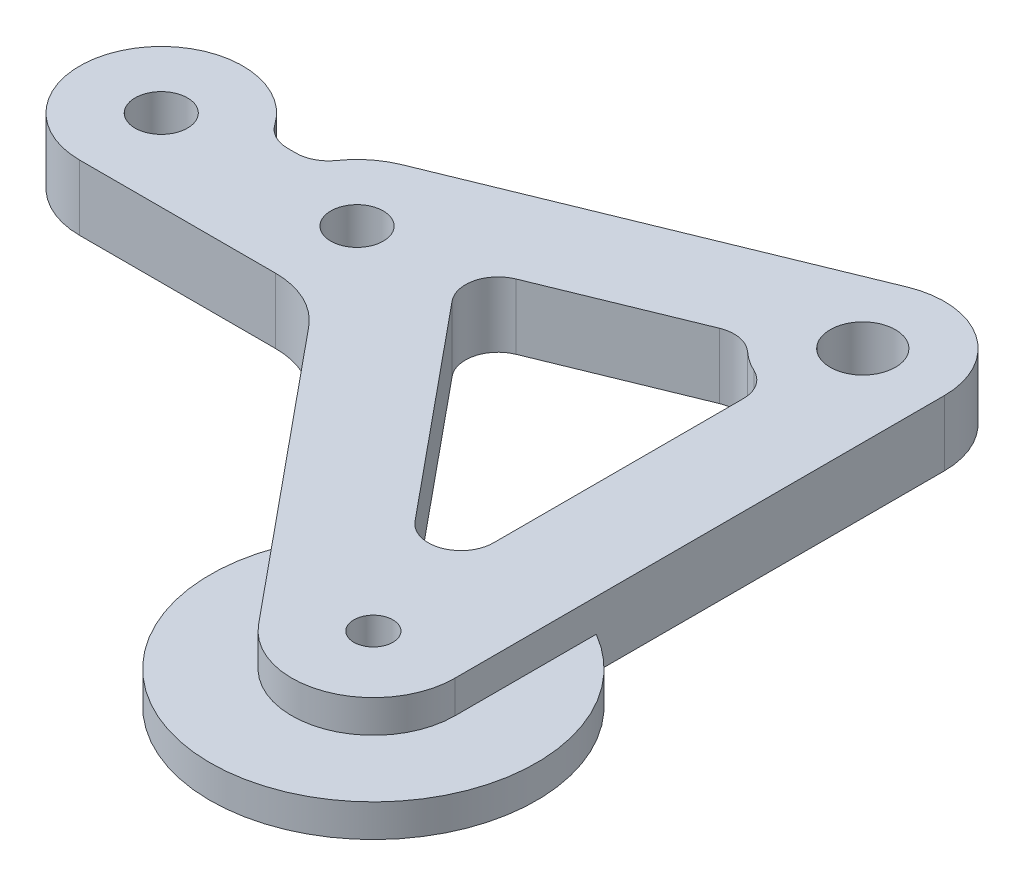
ISO-10303-21;
HEADER;
FILE_DESCRIPTION(('STEP AP214'),'2;1');
FILE_NAME('part.step','',(''),(''),'','','');
FILE_SCHEMA(('AUTOMOTIVE_DESIGN { 1 0 10303 214 1 1 1 1 }'));
ENDSEC;
DATA;
#1=APPLICATION_CONTEXT('core data for automotive mechanical design processes');
#2=APPLICATION_PROTOCOL_DEFINITION('international standard','automotive_design',2000,#1);
#3=PRODUCT_CONTEXT('',#1,'mechanical');
#4=PRODUCT('Part','Part','',(#3));
#5=PRODUCT_RELATED_PRODUCT_CATEGORY('part','',(#4));
#6=PRODUCT_DEFINITION_FORMATION('','',#4);
#7=PRODUCT_DEFINITION_CONTEXT('part definition',#1,'design');
#8=PRODUCT_DEFINITION('design','',#6,#7);
#9=PRODUCT_DEFINITION_SHAPE('','',#8);
#10=(LENGTH_UNIT() NAMED_UNIT(*) SI_UNIT(.MILLI.,.METRE.));
#11=(NAMED_UNIT(*) PLANE_ANGLE_UNIT() SI_UNIT($,.RADIAN.));
#12=(NAMED_UNIT(*) SI_UNIT($,.STERADIAN.) SOLID_ANGLE_UNIT());
#13=UNCERTAINTY_MEASURE_WITH_UNIT(LENGTH_MEASURE(1.E-05),#10,'distance_accuracy_value','');
#14=(GEOMETRIC_REPRESENTATION_CONTEXT(3) GLOBAL_UNCERTAINTY_ASSIGNED_CONTEXT((#13)) GLOBAL_UNIT_ASSIGNED_CONTEXT((#10,
#11,#12)) REPRESENTATION_CONTEXT('',''));
#15=CARTESIAN_POINT('',(0.,0.,0.));
#16=DIRECTION('',(0.,0.,1.));
#17=DIRECTION('',(1.,0.,0.));
#18=AXIS2_PLACEMENT_3D('',#15,#16,#17);
#19=CARTESIAN_POINT('',(0.,6.35,0.));
#20=DIRECTION('',(0.,-1.,0.));
#21=DIRECTION('',(0.,0.,-1.));
#22=AXIS2_PLACEMENT_3D('',#19,#20,#21);
#23=PLANE('',#22);
#24=CARTESIAN_POINT('',(53.975,6.35,33.3375));
#25=DIRECTION('',(0.,1.,0.));
#26=DIRECTION('',(0.,0.,1.));
#27=AXIS2_PLACEMENT_3D('',#24,#25,#26);
#28=CIRCLE('',#27,1.89865);
#29=CARTESIAN_POINT('',(53.975,6.35,35.23615));
#30=VERTEX_POINT('',#29);
#31=EDGE_CURVE('E196',#30,#30,#28,.T.);
#32=ORIENTED_EDGE('',*,*,#31,.F.);
#33=EDGE_LOOP('',(#32));
#34=FACE_BOUND('',#33,.T.);
#35=CARTESIAN_POINT('',(53.975,6.35,-14.2875));
#36=DIRECTION('',(0.,1.,0.));
#37=DIRECTION('',(0.,0.,1.));
#38=AXIS2_PLACEMENT_3D('',#35,#36,#37);
#39=CIRCLE('',#38,3.175);
#40=CARTESIAN_POINT('',(53.975,6.35,-11.1125));
#41=VERTEX_POINT('',#40);
#42=EDGE_CURVE('E218',#41,#41,#39,.T.);
#43=ORIENTED_EDGE('',*,*,#42,.F.);
#44=EDGE_LOOP('',(#43));
#45=FACE_BOUND('',#44,.T.);
#46=CARTESIAN_POINT('',(0.,6.35,0.));
#47=DIRECTION('',(0.,1.,0.));
#48=DIRECTION('',(0.,0.,1.));
#49=AXIS2_PLACEMENT_3D('',#46,#47,#48);
#50=CIRCLE('',#49,2.5527);
#51=CARTESIAN_POINT('',(0.,6.35,2.5527));
#52=VERTEX_POINT('',#51);
#53=EDGE_CURVE('E224',#52,#52,#50,.T.);
#54=ORIENTED_EDGE('',*,*,#53,.F.);
#55=EDGE_LOOP('',(#54));
#56=FACE_BOUND('',#55,.T.);
#57=CARTESIAN_POINT('',(19.05,6.35,0.));
#58=DIRECTION('',(0.,1.,0.));
#59=DIRECTION('',(0.,0.,1.));
#60=AXIS2_PLACEMENT_3D('',#57,#58,#59);
#61=CIRCLE('',#60,2.5527);
#62=CARTESIAN_POINT('',(19.05,6.35,2.5527));
#63=VERTEX_POINT('',#62);
#64=EDGE_CURVE('E230',#63,#63,#61,.T.);
#65=ORIENTED_EDGE('',*,*,#64,.F.);
#66=EDGE_LOOP('',(#65));
#67=FACE_BOUND('',#66,.T.);
#68=DIRECTION('',(-0.925546956205677,0.,0.378632845720504));
#69=VECTOR('',#68,1.);
#70=CARTESIAN_POINT('',(47.3779807047656,6.35,-9.87351736882614));
#71=LINE('',#70,#69);
#72=CARTESIAN_POINT('',(45.2833738724101,6.35,-9.01663275558981));
#73=VERTEX_POINT('',#72);
#74=CARTESIAN_POINT('',(31.2380412336581,6.35,-3.27081485791855));
#75=VERTEX_POINT('',#74);
#76=EDGE_CURVE('E237',#73,#75,#71,.T.);
#77=ORIENTED_EDGE('',*,*,#76,.F.);
#78=CARTESIAN_POINT('',(46.4855331575727,6.35,-6.07802116963678));
#79=DIRECTION('',(0.,-1.,0.));
#80=DIRECTION('',(0.,0.,-1.));
#81=AXIS2_PLACEMENT_3D('',#78,#79,#80);
#82=CIRCLE('',#81,3.175);
#83=CARTESIAN_POINT('',(48.6253808268376,6.35,-8.42358654974056));
#84=VERTEX_POINT('',#83);
#85=EDGE_CURVE('E349',#73,#84,#82,.T.);
#86=ORIENTED_EDGE('',*,*,#85,.T.);
#87=CARTESIAN_POINT('',(53.975,6.35,-14.2875));
#88=DIRECTION('',(0.,-1.,0.));
#89=DIRECTION('',(0.,0.,1.));
#90=AXIS2_PLACEMENT_3D('',#87,#88,#89);
#91=CIRCLE('',#90,7.9375);
#92=CARTESIAN_POINT('',(50.5732142857143,6.35,-7.11590602068957));
#93=VERTEX_POINT('',#92);
#94=EDGE_CURVE('E247',#93,#84,#91,.T.);
#95=ORIENTED_EDGE('',*,*,#94,.F.);
#96=CARTESIAN_POINT('',(49.2125,6.35,-4.2472684289654));
#97=DIRECTION('',(0.,-1.,0.));
#98=DIRECTION('',(0.,0.,-1.));
#99=AXIS2_PLACEMENT_3D('',#96,#97,#98);
#100=CIRCLE('',#99,3.175);
#101=CARTESIAN_POINT('',(52.3875,6.35,-4.2472684289654));
#102=VERTEX_POINT('',#101);
#103=EDGE_CURVE('E345',#93,#102,#100,.T.);
#104=ORIENTED_EDGE('',*,*,#103,.T.);
#105=DIRECTION('',(0.,0.,-1.));
#106=VECTOR('',#105,1.);
#107=CARTESIAN_POINT('',(52.3875,6.35,28.9094062063656));
#108=LINE('',#107,#106);
#109=CARTESIAN_POINT('',(52.3875,6.35,20.0532186190968));
#110=VERTEX_POINT('',#109);
#111=EDGE_CURVE('E244',#110,#102,#108,.T.);
#112=ORIENTED_EDGE('',*,*,#111,.F.);
#113=CARTESIAN_POINT('',(49.2125,6.35,20.0532186190968));
#114=DIRECTION('',(0.,-1.,0.));
#115=DIRECTION('',(0.,0.,-1.));
#116=AXIS2_PLACEMENT_3D('',#113,#114,#115);
#117=CIRCLE('',#116,3.175);
#118=CARTESIAN_POINT('',(46.760695435505,6.35,22.0704641117232));
#119=VERTEX_POINT('',#118);
#120=EDGE_CURVE('E353',#110,#119,#117,.T.);
#121=ORIENTED_EDGE('',*,*,#120,.T.);
#122=DIRECTION('',(0.635352911063427,0.,0.772221910077168));
#123=VECTOR('',#122,1.);
#124=CARTESIAN_POINT('',(27.2524136717419,6.35,-1.64033085531647));
#125=LINE('',#124,#123);
#126=CARTESIAN_POINT('',(29.9883959543257,6.35,1.68504222066086));
#127=VERTEX_POINT('',#126);
#128=EDGE_CURVE('E240',#127,#119,#125,.T.);
#129=ORIENTED_EDGE('',*,*,#128,.F.);
#130=CARTESIAN_POINT('',(32.4402005188207,6.35,-0.332203271965525));
#131=DIRECTION('',(0.,-1.,0.));
#132=DIRECTION('',(0.,0.,-1.));
#133=AXIS2_PLACEMENT_3D('',#130,#131,#132);
#134=CIRCLE('',#133,3.175);
#135=EDGE_CURVE('E357',#127,#75,#134,.T.);
#136=ORIENTED_EDGE('',*,*,#135,.T.);
#137=EDGE_LOOP('',(#77,#86,#95,#104,#112,#121,#129,#136));
#138=FACE_BOUND('',#137,.T.);
#139=CARTESIAN_POINT('',(9.11949320137912,6.35,-6.35));
#140=DIRECTION('',(0.,-1.,0.));
#141=DIRECTION('',(0.,0.,-1.));
#142=AXIS2_PLACEMENT_3D('',#139,#140,#141);
#143=CIRCLE('',#142,3.175);
#144=CARTESIAN_POINT('',(9.11949320137912,6.35,-3.175));
#145=VERTEX_POINT('',#144);
#146=CARTESIAN_POINT('',(6.5139237152708,6.35,-4.53571428571429));
#147=VERTEX_POINT('',#146);
#148=EDGE_CURVE('E11',#145,#147,#143,.T.);
#149=ORIENTED_EDGE('',*,*,#148,.T.);
#150=CARTESIAN_POINT('',(0.,6.35,0.));
#151=DIRECTION('',(0.,1.,0.));
#152=DIRECTION('',(0.,0.,-1.));
#153=AXIS2_PLACEMENT_3D('',#150,#151,#152);
#154=CIRCLE('',#153,7.9375);
#155=CARTESIAN_POINT('',(0.,6.35,7.9375));
#156=VERTEX_POINT('',#155);
#157=EDGE_CURVE('E58',#147,#156,#154,.T.);
#158=ORIENTED_EDGE('',*,*,#157,.T.);
#159=DIRECTION('',(1.,0.,0.));
#160=VECTOR('',#159,1.);
#161=CARTESIAN_POINT('',(0.,6.35,7.9375));
#162=LINE('',#161,#160);
#163=CARTESIAN_POINT('',(19.05,6.35,7.9375));
#164=VERTEX_POINT('',#163);
#165=EDGE_CURVE('E262',#156,#164,#162,.T.);
#166=ORIENTED_EDGE('',*,*,#165,.T.);
#167=CARTESIAN_POINT('',(19.05,6.35,15.875));
#168=DIRECTION('',(0.,-1.,0.));
#169=DIRECTION('',(0.,0.,-1.));
#170=AXIS2_PLACEMENT_3D('',#167,#168,#169);
#171=CIRCLE('',#170,7.93750000000001);
#172=CARTESIAN_POINT('',(25.1795114112375,6.35,10.831886268434));
#173=VERTEX_POINT('',#172);
#174=EDGE_CURVE('E265',#164,#173,#171,.T.);
#175=ORIENTED_EDGE('',*,*,#174,.T.);
#176=DIRECTION('',(0.635352911063427,0.,0.772221910077168));
#177=VECTOR('',#176,1.);
#178=CARTESIAN_POINT('',(47.8454885887625,6.35,38.3806137315659));
#179=LINE('',#178,#177);
#180=CARTESIAN_POINT('',(47.8454885887625,6.35,38.3806137315659));
#181=VERTEX_POINT('',#180);
#182=EDGE_CURVE('E267',#173,#181,#179,.T.);
#183=ORIENTED_EDGE('',*,*,#182,.T.);
#184=CARTESIAN_POINT('',(53.975,6.35,33.3375));
#185=DIRECTION('',(0.,1.,0.));
#186=DIRECTION('',(0.,0.,-1.));
#187=AXIS2_PLACEMENT_3D('',#184,#185,#186);
#188=CIRCLE('',#187,7.93749999999999);
#189=CARTESIAN_POINT('',(61.9125,6.35,33.3375));
#190=VERTEX_POINT('',#189);
#191=EDGE_CURVE('E269',#181,#190,#188,.T.);
#192=ORIENTED_EDGE('',*,*,#191,.T.);
#193=DIRECTION('',(0.,0.,-1.));
#194=VECTOR('',#193,1.);
#195=CARTESIAN_POINT('',(61.9125,6.35,-14.2875));
#196=LINE('',#195,#194);
#197=CARTESIAN_POINT('',(61.9125,6.35,-14.2875));
#198=VERTEX_POINT('',#197);
#199=EDGE_CURVE('E271',#190,#198,#196,.T.);
#200=ORIENTED_EDGE('',*,*,#199,.T.);
#201=CARTESIAN_POINT('',(53.975,6.35,-14.2875));
#202=DIRECTION('',(0.,1.,0.));
#203=DIRECTION('',(0.,0.,1.));
#204=AXIS2_PLACEMENT_3D('',#201,#202,#203);
#205=CIRCLE('',#204,7.9375);
#206=CARTESIAN_POINT('',(50.9696017870935,6.35,-21.6340289648826));
#207=VERTEX_POINT('',#206);
#208=EDGE_CURVE('E273',#198,#207,#205,.T.);
#209=ORIENTED_EDGE('',*,*,#208,.T.);
#210=DIRECTION('',(-0.925546956205677,0.,0.378632845720504));
#211=VECTOR('',#210,1.);
#212=CARTESIAN_POINT('',(16.0446017870935,6.35,-7.34652896488256));
#213=LINE('',#212,#211);
#214=CARTESIAN_POINT('',(16.0446017870935,6.35,-7.34652896488256));
#215=VERTEX_POINT('',#214);
#216=EDGE_CURVE('E275',#207,#215,#213,.T.);
#217=ORIENTED_EDGE('',*,*,#216,.T.);
#218=CARTESIAN_POINT('',(19.05,6.35,0.));
#219=DIRECTION('',(0.,1.,0.));
#220=DIRECTION('',(0.,0.,1.));
#221=AXIS2_PLACEMENT_3D('',#218,#219,#220);
#222=CIRCLE('',#221,7.9375);
#223=CARTESIAN_POINT('',(12.5360762847292,6.35,-4.53571428571429));
#224=VERTEX_POINT('',#223);
#225=EDGE_CURVE('E277',#215,#224,#222,.T.);
#226=ORIENTED_EDGE('',*,*,#225,.T.);
#227=CARTESIAN_POINT('',(9.93050679862088,6.35,-6.35));
#228=DIRECTION('',(0.,-1.,0.));
#229=DIRECTION('',(0.,0.,-1.));
#230=AXIS2_PLACEMENT_3D('',#227,#228,#229);
#231=CIRCLE('',#230,3.175);
#232=CARTESIAN_POINT('',(9.93050679862088,6.35,-3.175));
#233=VERTEX_POINT('',#232);
#234=EDGE_CURVE('E370',#224,#233,#231,.T.);
#235=ORIENTED_EDGE('',*,*,#234,.T.);
#236=DIRECTION('',(-1.,0.,0.));
#237=VECTOR('',#236,1.);
#238=CARTESIAN_POINT('',(7.2748389157424,6.35,-3.175));
#239=LINE('',#238,#237);
#240=EDGE_CURVE('E280',#233,#145,#239,.T.);
#241=ORIENTED_EDGE('',*,*,#240,.T.);
#242=EDGE_LOOP('',(#149,#158,#166,#175,#183,#192,#200,#209,#217,#226,#235,#241));
#243=FACE_BOUND('',#242,.T.);
#244=ADVANCED_FACE('F35',(#34,#45,#56,#67,#138,#243),#23,.F.);
#245=CARTESIAN_POINT('',(0.,0.,0.));
#246=DIRECTION('',(0.,-1.,0.));
#247=DIRECTION('',(0.,0.,-1.));
#248=AXIS2_PLACEMENT_3D('',#245,#246,#247);
#249=PLANE('',#248);
#250=CARTESIAN_POINT('',(0.,0.,0.));
#251=DIRECTION('',(0.,1.,0.));
#252=DIRECTION('',(0.,0.,-1.));
#253=AXIS2_PLACEMENT_3D('',#250,#251,#252);
#254=CIRCLE('',#253,7.9375);
#255=CARTESIAN_POINT('',(6.5139237152708,0.,-4.53571428571429));
#256=VERTEX_POINT('',#255);
#257=CARTESIAN_POINT('',(0.,0.,7.9375));
#258=VERTEX_POINT('',#257);
#259=EDGE_CURVE('E250',#256,#258,#254,.T.);
#260=ORIENTED_EDGE('',*,*,#259,.F.);
#261=CARTESIAN_POINT('',(9.11949320137912,0.,-6.35));
#262=DIRECTION('',(0.,-1.,0.));
#263=DIRECTION('',(0.,0.,-1.));
#264=AXIS2_PLACEMENT_3D('',#261,#262,#263);
#265=CIRCLE('',#264,3.175);
#266=CARTESIAN_POINT('',(9.11949320137912,0.,-3.175));
#267=VERTEX_POINT('',#266);
#268=EDGE_CURVE('E43',#256,#267,#265,.F.);
#269=ORIENTED_EDGE('',*,*,#268,.T.);
#270=DIRECTION('',(-1.,0.,0.));
#271=VECTOR('',#270,1.);
#272=CARTESIAN_POINT('',(7.2748389157424,0.,-3.175));
#273=LINE('',#272,#271);
#274=CARTESIAN_POINT('',(9.93050679862088,0.,-3.175));
#275=VERTEX_POINT('',#274);
#276=EDGE_CURVE('E263',#275,#267,#273,.T.);
#277=ORIENTED_EDGE('',*,*,#276,.F.);
#278=CARTESIAN_POINT('',(9.93050679862088,0.,-6.35));
#279=DIRECTION('',(0.,-1.,0.));
#280=DIRECTION('',(0.,0.,-1.));
#281=AXIS2_PLACEMENT_3D('',#278,#279,#280);
#282=CIRCLE('',#281,3.175);
#283=CARTESIAN_POINT('',(12.5360762847292,0.,-4.53571428571429));
#284=VERTEX_POINT('',#283);
#285=EDGE_CURVE('E368',#275,#284,#282,.F.);
#286=ORIENTED_EDGE('',*,*,#285,.T.);
#287=CARTESIAN_POINT('',(19.05,0.,0.));
#288=DIRECTION('',(0.,1.,0.));
#289=DIRECTION('',(0.,0.,1.));
#290=AXIS2_PLACEMENT_3D('',#287,#288,#289);
#291=CIRCLE('',#290,7.9375);
#292=CARTESIAN_POINT('',(16.0446017870935,0.,-7.34652896488256));
#293=VERTEX_POINT('',#292);
#294=EDGE_CURVE('E297',#293,#284,#291,.T.);
#295=ORIENTED_EDGE('',*,*,#294,.F.);
#296=DIRECTION('',(-0.925546956205677,0.,0.378632845720504));
#297=VECTOR('',#296,1.);
#298=CARTESIAN_POINT('',(16.0446017870935,0.,-7.34652896488256));
#299=LINE('',#298,#297);
#300=CARTESIAN_POINT('',(50.9696017870935,0.,-21.6340289648826));
#301=VERTEX_POINT('',#300);
#302=EDGE_CURVE('E295',#301,#293,#299,.T.);
#303=ORIENTED_EDGE('',*,*,#302,.F.);
#304=CARTESIAN_POINT('',(53.975,0.,-14.2875));
#305=DIRECTION('',(0.,1.,0.));
#306=DIRECTION('',(0.,0.,1.));
#307=AXIS2_PLACEMENT_3D('',#304,#305,#306);
#308=CIRCLE('',#307,7.9375);
#309=CARTESIAN_POINT('',(61.9125,0.,-14.2875));
#310=VERTEX_POINT('',#309);
#311=EDGE_CURVE('E293',#310,#301,#308,.T.);
#312=ORIENTED_EDGE('',*,*,#311,.F.);
#313=DIRECTION('',(0.,0.,-1.));
#314=VECTOR('',#313,1.);
#315=CARTESIAN_POINT('',(61.9125,0.,-14.2875));
#316=LINE('',#315,#314);
#317=CARTESIAN_POINT('',(61.9125,0.,19.589346714922));
#318=VERTEX_POINT('',#317);
#319=EDGE_CURVE('E291',#318,#310,#316,.T.);
#320=ORIENTED_EDGE('',*,*,#319,.F.);
#321=CARTESIAN_POINT('',(53.975,0.,33.3375));
#322=DIRECTION('',(0.,-1.,0.));
#323=DIRECTION('',(0.,0.,-1.));
#324=AXIS2_PLACEMENT_3D('',#321,#322,#323);
#325=CIRCLE('',#324,15.875);
#326=CARTESIAN_POINT('',(39.110559377342,0.,27.7639885417293));
#327=VERTEX_POINT('',#326);
#328=EDGE_CURVE('E50',#327,#318,#325,.F.);
#329=ORIENTED_EDGE('',*,*,#328,.F.);
#330=DIRECTION('',(0.635352911063427,0.,0.772221910077168));
#331=VECTOR('',#330,1.);
#332=CARTESIAN_POINT('',(47.8454885887625,0.,38.3806137315659));
#333=LINE('',#332,#331);
#334=CARTESIAN_POINT('',(25.1795114112375,0.,10.831886268434));
#335=VERTEX_POINT('',#334);
#336=EDGE_CURVE('E206',#335,#327,#333,.T.);
#337=ORIENTED_EDGE('',*,*,#336,.F.);
#338=CARTESIAN_POINT('',(19.05,0.,15.875));
#339=DIRECTION('',(0.,-1.,0.));
#340=DIRECTION('',(0.,0.,-1.));
#341=AXIS2_PLACEMENT_3D('',#338,#339,#340);
#342=CIRCLE('',#341,7.93750000000001);
#343=CARTESIAN_POINT('',(19.05,0.,7.9375));
#344=VERTEX_POINT('',#343);
#345=EDGE_CURVE('E288',#344,#335,#342,.T.);
#346=ORIENTED_EDGE('',*,*,#345,.F.);
#347=DIRECTION('',(1.,0.,0.));
#348=VECTOR('',#347,1.);
#349=CARTESIAN_POINT('',(0.,0.,7.9375));
#350=LINE('',#349,#348);
#351=EDGE_CURVE('E286',#258,#344,#350,.T.);
#352=ORIENTED_EDGE('',*,*,#351,.F.);
#353=EDGE_LOOP('',(#260,#269,#277,#286,#295,#303,#312,#320,#329,#337,#346,#352));
#354=FACE_BOUND('',#353,.T.);
#355=CARTESIAN_POINT('',(53.975,0.,33.3375));
#356=DIRECTION('',(0.,1.,0.));
#357=DIRECTION('',(0.,0.,1.));
#358=AXIS2_PLACEMENT_3D('',#355,#356,#357);
#359=CIRCLE('',#358,1.89864999999999);
#360=CARTESIAN_POINT('',(53.975,0.,35.23615));
#361=VERTEX_POINT('',#360);
#362=EDGE_CURVE('E215',#361,#361,#359,.T.);
#363=ORIENTED_EDGE('',*,*,#362,.T.);
#364=EDGE_LOOP('',(#363));
#365=FACE_BOUND('',#364,.T.);
#366=CARTESIAN_POINT('',(53.975,0.,-14.2875));
#367=DIRECTION('',(0.,1.,0.));
#368=DIRECTION('',(0.,0.,1.));
#369=AXIS2_PLACEMENT_3D('',#366,#367,#368);
#370=CIRCLE('',#369,3.175);
#371=CARTESIAN_POINT('',(53.975,0.,-11.1125));
#372=VERTEX_POINT('',#371);
#373=EDGE_CURVE('E221',#372,#372,#370,.T.);
#374=ORIENTED_EDGE('',*,*,#373,.T.);
#375=EDGE_LOOP('',(#374));
#376=FACE_BOUND('',#375,.T.);
#377=CARTESIAN_POINT('',(0.,0.,0.));
#378=DIRECTION('',(0.,1.,0.));
#379=DIRECTION('',(0.,0.,1.));
#380=AXIS2_PLACEMENT_3D('',#377,#378,#379);
#381=CIRCLE('',#380,2.5527);
#382=CARTESIAN_POINT('',(0.,0.,2.5527));
#383=VERTEX_POINT('',#382);
#384=EDGE_CURVE('E227',#383,#383,#381,.T.);
#385=ORIENTED_EDGE('',*,*,#384,.T.);
#386=EDGE_LOOP('',(#385));
#387=FACE_BOUND('',#386,.T.);
#388=CARTESIAN_POINT('',(19.05,0.,0.));
#389=DIRECTION('',(0.,1.,0.));
#390=DIRECTION('',(0.,0.,1.));
#391=AXIS2_PLACEMENT_3D('',#388,#389,#390);
#392=CIRCLE('',#391,2.5527);
#393=CARTESIAN_POINT('',(19.05,0.,2.5527));
#394=VERTEX_POINT('',#393);
#395=EDGE_CURVE('E233',#394,#394,#392,.T.);
#396=ORIENTED_EDGE('',*,*,#395,.T.);
#397=EDGE_LOOP('',(#396));
#398=FACE_BOUND('',#397,.T.);
#399=DIRECTION('',(0.,0.,-1.));
#400=VECTOR('',#399,1.);
#401=CARTESIAN_POINT('',(52.3875,0.,28.9094062063656));
#402=LINE('',#401,#400);
#403=CARTESIAN_POINT('',(52.3875,0.,20.0532186190968));
#404=VERTEX_POINT('',#403);
#405=CARTESIAN_POINT('',(52.3875,0.,-4.2472684289654));
#406=VERTEX_POINT('',#405);
#407=EDGE_CURVE('E256',#404,#406,#402,.T.);
#408=ORIENTED_EDGE('',*,*,#407,.T.);
#409=CARTESIAN_POINT('',(49.2125,0.,-4.2472684289654));
#410=DIRECTION('',(0.,-1.,0.));
#411=DIRECTION('',(0.,0.,-1.));
#412=AXIS2_PLACEMENT_3D('',#409,#410,#411);
#413=CIRCLE('',#412,3.175);
#414=CARTESIAN_POINT('',(50.5732142857143,0.,-7.11590602068957));
#415=VERTEX_POINT('',#414);
#416=EDGE_CURVE('E343',#406,#415,#413,.F.);
#417=ORIENTED_EDGE('',*,*,#416,.T.);
#418=CARTESIAN_POINT('',(53.975,0.,-14.2875));
#419=DIRECTION('',(0.,-1.,0.));
#420=DIRECTION('',(0.,0.,1.));
#421=AXIS2_PLACEMENT_3D('',#418,#419,#420);
#422=CIRCLE('',#421,7.9375);
#423=CARTESIAN_POINT('',(48.6253808268376,0.,-8.42358654974056));
#424=VERTEX_POINT('',#423);
#425=EDGE_CURVE('E241',#415,#424,#422,.T.);
#426=ORIENTED_EDGE('',*,*,#425,.T.);
#427=CARTESIAN_POINT('',(46.4855331575727,0.,-6.07802116963678));
#428=DIRECTION('',(0.,-1.,0.));
#429=DIRECTION('',(0.,0.,-1.));
#430=AXIS2_PLACEMENT_3D('',#427,#428,#429);
#431=CIRCLE('',#430,3.175);
#432=CARTESIAN_POINT('',(45.2833738724101,0.,-9.01663275558981));
#433=VERTEX_POINT('',#432);
#434=EDGE_CURVE('E347',#424,#433,#431,.F.);
#435=ORIENTED_EDGE('',*,*,#434,.T.);
#436=DIRECTION('',(-0.925546956205677,0.,0.378632845720504));
#437=VECTOR('',#436,1.);
#438=CARTESIAN_POINT('',(47.3779807047656,0.,-9.87351736882614));
#439=LINE('',#438,#437);
#440=CARTESIAN_POINT('',(31.2380412336581,0.,-3.27081485791855));
#441=VERTEX_POINT('',#440);
#442=EDGE_CURVE('E236',#433,#441,#439,.T.);
#443=ORIENTED_EDGE('',*,*,#442,.T.);
#444=CARTESIAN_POINT('',(32.4402005188207,0.,-0.332203271965525));
#445=DIRECTION('',(0.,-1.,0.));
#446=DIRECTION('',(0.,0.,-1.));
#447=AXIS2_PLACEMENT_3D('',#444,#445,#446);
#448=CIRCLE('',#447,3.175);
#449=CARTESIAN_POINT('',(29.9883959543257,0.,1.68504222066086));
#450=VERTEX_POINT('',#449);
#451=EDGE_CURVE('E355',#441,#450,#448,.F.);
#452=ORIENTED_EDGE('',*,*,#451,.T.);
#453=DIRECTION('',(0.635352911063427,0.,0.772221910077168));
#454=VECTOR('',#453,1.);
#455=CARTESIAN_POINT('',(27.2524136717419,0.,-1.64033085531647));
#456=LINE('',#455,#454);
#457=CARTESIAN_POINT('',(46.760695435505,0.,22.0704641117232));
#458=VERTEX_POINT('',#457);
#459=EDGE_CURVE('E253',#450,#458,#456,.T.);
#460=ORIENTED_EDGE('',*,*,#459,.T.);
#461=CARTESIAN_POINT('',(49.2125,0.,20.0532186190968));
#462=DIRECTION('',(0.,-1.,0.));
#463=DIRECTION('',(0.,0.,-1.));
#464=AXIS2_PLACEMENT_3D('',#461,#462,#463);
#465=CIRCLE('',#464,3.175);
#466=EDGE_CURVE('E351',#458,#404,#465,.F.);
#467=ORIENTED_EDGE('',*,*,#466,.T.);
#468=EDGE_LOOP('',(#408,#417,#426,#435,#443,#452,#460,#467));
#469=FACE_BOUND('',#468,.T.);
#470=ADVANCED_FACE('F374',(#354,#365,#376,#387,#398,#469),#249,.T.);
#471=CARTESIAN_POINT('',(0.,6.35,7.9375));
#472=DIRECTION('',(0.,0.,-1.));
#473=DIRECTION('',(-1.,0.,0.));
#474=AXIS2_PLACEMENT_3D('',#471,#472,#473);
#475=PLANE('',#474);
#476=ORIENTED_EDGE('',*,*,#351,.T.);
#477=DIRECTION('',(0.,-1.,0.));
#478=VECTOR('',#477,1.);
#479=CARTESIAN_POINT('',(19.05,6.35,7.9375));
#480=LINE('',#479,#478);
#481=EDGE_CURVE('E317',#164,#344,#480,.T.);
#482=ORIENTED_EDGE('',*,*,#481,.F.);
#483=ORIENTED_EDGE('',*,*,#165,.F.);
#484=DIRECTION('',(0.,-1.,0.));
#485=VECTOR('',#484,1.);
#486=CARTESIAN_POINT('',(0.,6.35,7.9375));
#487=LINE('',#486,#485);
#488=EDGE_CURVE('E320',#156,#258,#487,.T.);
#489=ORIENTED_EDGE('',*,*,#488,.T.);
#490=EDGE_LOOP('',(#476,#482,#483,#489));
#491=FACE_BOUND('',#490,.T.);
#492=ADVANCED_FACE('F421',(#491),#475,.F.);
#493=CARTESIAN_POINT('',(19.05,6.35,15.875));
#494=DIRECTION('',(0.,-1.,0.));
#495=DIRECTION('',(0.,0.,-1.));
#496=AXIS2_PLACEMENT_3D('',#493,#494,#495);
#497=CYLINDRICAL_SURFACE('',#496,7.93750000000001);
#498=ORIENTED_EDGE('',*,*,#345,.T.);
#499=DIRECTION('',(0.,-1.,0.));
#500=VECTOR('',#499,1.);
#501=CARTESIAN_POINT('',(25.1795114112375,6.35,10.831886268434));
#502=LINE('',#501,#500);
#503=EDGE_CURVE('E315',#173,#335,#502,.T.);
#504=ORIENTED_EDGE('',*,*,#503,.F.);
#505=ORIENTED_EDGE('',*,*,#174,.F.);
#506=ORIENTED_EDGE('',*,*,#481,.T.);
#507=EDGE_LOOP('',(#498,#504,#505,#506));
#508=FACE_BOUND('',#507,.T.);
#509=ADVANCED_FACE('F418',(#508),#497,.F.);
#510=CARTESIAN_POINT('',(47.8454885887625,6.35,38.3806137315659));
#511=DIRECTION('',(0.772221910077168,0.,-0.635352911063427));
#512=DIRECTION('',(-0.635352911063427,0.,-0.772221910077168));
#513=AXIS2_PLACEMENT_3D('',#510,#511,#512);
#514=PLANE('',#513);
#515=DIRECTION('',(0.,1.,0.));
#516=VECTOR('',#515,1.);
#517=CARTESIAN_POINT('',(39.110559377342,-43.4234235240754,27.7639885417293));
#518=LINE('',#517,#516);
#519=CARTESIAN_POINT('',(39.110559377342,3.175,27.7639885417293));
#520=VERTEX_POINT('',#519);
#521=EDGE_CURVE('E197',#327,#520,#518,.T.);
#522=ORIENTED_EDGE('',*,*,#521,.T.);
#523=DIRECTION('',(0.635352911063427,0.,0.772221910077168));
#524=VECTOR('',#523,1.);
#525=CARTESIAN_POINT('',(39.110559377342,3.175,27.7639885417293));
#526=LINE('',#525,#524);
#527=CARTESIAN_POINT('',(47.8454885887625,3.175,38.3806137315659));
#528=VERTEX_POINT('',#527);
#529=EDGE_CURVE('E185',#520,#528,#526,.T.);
#530=ORIENTED_EDGE('',*,*,#529,.T.);
#531=DIRECTION('',(0.,-1.,0.));
#532=VECTOR('',#531,1.);
#533=CARTESIAN_POINT('',(47.8454885887625,6.35,38.3806137315659));
#534=LINE('',#533,#532);
#535=EDGE_CURVE('E313',#181,#528,#534,.T.);
#536=ORIENTED_EDGE('',*,*,#535,.F.);
#537=ORIENTED_EDGE('',*,*,#182,.F.);
#538=ORIENTED_EDGE('',*,*,#503,.T.);
#539=ORIENTED_EDGE('',*,*,#336,.T.);
#540=EDGE_LOOP('',(#522,#530,#536,#537,#538,#539));
#541=FACE_BOUND('',#540,.T.);
#542=ADVANCED_FACE('F203',(#541),#514,.F.);
#543=CARTESIAN_POINT('',(53.975,6.35,33.3375));
#544=DIRECTION('',(0.,-1.,0.));
#545=DIRECTION('',(0.,0.,-1.));
#546=AXIS2_PLACEMENT_3D('',#543,#544,#545);
#547=CYLINDRICAL_SURFACE('',#546,7.93749999999999);
#548=ORIENTED_EDGE('',*,*,#535,.T.);
#549=CARTESIAN_POINT('',(53.975,3.175,33.3375));
#550=DIRECTION('',(0.,1.,0.));
#551=DIRECTION('',(0.,0.,1.));
#552=AXIS2_PLACEMENT_3D('',#549,#550,#551);
#553=CIRCLE('',#552,7.93749999999999);
#554=CARTESIAN_POINT('',(61.9125,3.175,33.3375));
#555=VERTEX_POINT('',#554);
#556=EDGE_CURVE('E191',#528,#555,#553,.T.);
#557=ORIENTED_EDGE('',*,*,#556,.T.);
#558=DIRECTION('',(0.,-1.,0.));
#559=VECTOR('',#558,1.);
#560=CARTESIAN_POINT('',(61.9125,6.35,33.3375));
#561=LINE('',#560,#559);
#562=EDGE_CURVE('E310',#190,#555,#561,.T.);
#563=ORIENTED_EDGE('',*,*,#562,.F.);
#564=ORIENTED_EDGE('',*,*,#191,.F.);
#565=EDGE_LOOP('',(#548,#557,#563,#564));
#566=FACE_BOUND('',#565,.T.);
#567=ADVANCED_FACE('F411',(#566),#547,.T.);
#568=CARTESIAN_POINT('',(61.9125,6.35,-14.2875));
#569=DIRECTION('',(-1.,0.,0.));
#570=DIRECTION('',(0.,0.,1.));
#571=AXIS2_PLACEMENT_3D('',#568,#569,#570);
#572=PLANE('',#571);
#573=ORIENTED_EDGE('',*,*,#562,.T.);
#574=DIRECTION('',(0.,0.,-1.));
#575=VECTOR('',#574,1.);
#576=CARTESIAN_POINT('',(61.9125,3.175,33.3375));
#577=LINE('',#576,#575);
#578=CARTESIAN_POINT('',(61.9125,3.175,19.589346714922));
#579=VERTEX_POINT('',#578);
#580=EDGE_CURVE('E208',#555,#579,#577,.T.);
#581=ORIENTED_EDGE('',*,*,#580,.T.);
#582=DIRECTION('',(0.,1.,0.));
#583=VECTOR('',#582,1.);
#584=CARTESIAN_POINT('',(61.9125,-43.4234235240754,19.589346714922));
#585=LINE('',#584,#583);
#586=EDGE_CURVE('E201',#318,#579,#585,.T.);
#587=ORIENTED_EDGE('',*,*,#586,.F.);
#588=ORIENTED_EDGE('',*,*,#319,.T.);
#589=DIRECTION('',(0.,-1.,0.));
#590=VECTOR('',#589,1.);
#591=CARTESIAN_POINT('',(61.9125,6.35,-14.2875));
#592=LINE('',#591,#590);
#593=EDGE_CURVE('E307',#198,#310,#592,.T.);
#594=ORIENTED_EDGE('',*,*,#593,.F.);
#595=ORIENTED_EDGE('',*,*,#199,.F.);
#596=EDGE_LOOP('',(#573,#581,#587,#588,#594,#595));
#597=FACE_BOUND('',#596,.T.);
#598=ADVANCED_FACE('F407',(#597),#572,.F.);
#599=CARTESIAN_POINT('',(53.975,6.35,-14.2875));
#600=DIRECTION('',(0.,-1.,0.));
#601=DIRECTION('',(0.,0.,-1.));
#602=AXIS2_PLACEMENT_3D('',#599,#600,#601);
#603=CYLINDRICAL_SURFACE('',#602,7.9375);
#604=ORIENTED_EDGE('',*,*,#311,.T.);
#605=DIRECTION('',(0.,-1.,0.));
#606=VECTOR('',#605,1.);
#607=CARTESIAN_POINT('',(50.9696017870935,6.35,-21.6340289648826));
#608=LINE('',#607,#606);
#609=EDGE_CURVE('E304',#207,#301,#608,.T.);
#610=ORIENTED_EDGE('',*,*,#609,.F.);
#611=ORIENTED_EDGE('',*,*,#208,.F.);
#612=ORIENTED_EDGE('',*,*,#593,.T.);
#613=EDGE_LOOP('',(#604,#610,#611,#612));
#614=FACE_BOUND('',#613,.T.);
#615=ADVANCED_FACE('F402',(#614),#603,.T.);
#616=CARTESIAN_POINT('',(16.0446017870935,6.35,-7.34652896488256));
#617=DIRECTION('',(0.378632845720504,0.,0.925546956205677));
#618=DIRECTION('',(0.925546956205677,0.,-0.378632845720504));
#619=AXIS2_PLACEMENT_3D('',#616,#617,#618);
#620=PLANE('',#619);
#621=ORIENTED_EDGE('',*,*,#302,.T.);
#622=DIRECTION('',(0.,-1.,0.));
#623=VECTOR('',#622,1.);
#624=CARTESIAN_POINT('',(16.0446017870935,6.35,-7.34652896488256));
#625=LINE('',#624,#623);
#626=EDGE_CURVE('E283',#215,#293,#625,.T.);
#627=ORIENTED_EDGE('',*,*,#626,.F.);
#628=ORIENTED_EDGE('',*,*,#216,.F.);
#629=ORIENTED_EDGE('',*,*,#609,.T.);
#630=EDGE_LOOP('',(#621,#627,#628,#629));
#631=FACE_BOUND('',#630,.T.);
#632=ADVANCED_FACE('F397',(#631),#620,.F.);
#633=CARTESIAN_POINT('',(19.05,6.35,0.));
#634=DIRECTION('',(0.,-1.,0.));
#635=DIRECTION('',(0.,0.,-1.));
#636=AXIS2_PLACEMENT_3D('',#633,#634,#635);
#637=CYLINDRICAL_SURFACE('',#636,7.9375);
#638=ORIENTED_EDGE('',*,*,#294,.T.);
#639=DIRECTION('',(0.,-1.,0.));
#640=VECTOR('',#639,1.);
#641=CARTESIAN_POINT('',(12.5360762847292,6.35,-4.53571428571429));
#642=LINE('',#641,#640);
#643=EDGE_CURVE('E364',#284,#224,#642,.F.);
#644=ORIENTED_EDGE('',*,*,#643,.T.);
#645=ORIENTED_EDGE('',*,*,#225,.F.);
#646=ORIENTED_EDGE('',*,*,#626,.T.);
#647=EDGE_LOOP('',(#638,#644,#645,#646));
#648=FACE_BOUND('',#647,.T.);
#649=ADVANCED_FACE('F392',(#648),#637,.T.);
#650=CARTESIAN_POINT('',(7.2748389157424,6.35,-3.175));
#651=DIRECTION('',(0.,0.,1.));
#652=DIRECTION('',(1.,0.,0.));
#653=AXIS2_PLACEMENT_3D('',#650,#651,#652);
#654=PLANE('',#653);
#655=ORIENTED_EDGE('',*,*,#240,.F.);
#656=DIRECTION('',(0.,1.,0.));
#657=VECTOR('',#656,1.);
#658=CARTESIAN_POINT('',(9.93050679862088,0.,-3.175));
#659=LINE('',#658,#657);
#660=EDGE_CURVE('E361',#233,#275,#659,.F.);
#661=ORIENTED_EDGE('',*,*,#660,.T.);
#662=ORIENTED_EDGE('',*,*,#276,.T.);
#663=DIRECTION('',(0.,1.,0.));
#664=VECTOR('',#663,1.);
#665=CARTESIAN_POINT('',(9.11949320137912,6.35,-3.175));
#666=LINE('',#665,#664);
#667=EDGE_CURVE('E359',#267,#145,#666,.T.);
#668=ORIENTED_EDGE('',*,*,#667,.T.);
#669=EDGE_LOOP('',(#655,#661,#662,#668));
#670=FACE_BOUND('',#669,.T.);
#671=ADVANCED_FACE('F381',(#670),#654,.F.);
#672=CARTESIAN_POINT('',(0.,6.35,0.));
#673=DIRECTION('',(0.,-1.,0.));
#674=DIRECTION('',(0.,0.,-1.));
#675=AXIS2_PLACEMENT_3D('',#672,#673,#674);
#676=CYLINDRICAL_SURFACE('',#675,7.9375);
#677=ORIENTED_EDGE('',*,*,#157,.F.);
#678=DIRECTION('',(0.,-1.,0.));
#679=VECTOR('',#678,1.);
#680=CARTESIAN_POINT('',(6.5139237152708,6.35,-4.53571428571429));
#681=LINE('',#680,#679);
#682=EDGE_CURVE('E366',#147,#256,#681,.T.);
#683=ORIENTED_EDGE('',*,*,#682,.T.);
#684=ORIENTED_EDGE('',*,*,#259,.T.);
#685=ORIENTED_EDGE('',*,*,#488,.F.);
#686=EDGE_LOOP('',(#677,#683,#684,#685));
#687=FACE_BOUND('',#686,.T.);
#688=ADVANCED_FACE('F422',(#687),#676,.T.);
#689=CARTESIAN_POINT('',(47.3779807047656,6.35,-9.87351736882614));
#690=DIRECTION('',(0.378632845720504,0.,0.925546956205677));
#691=DIRECTION('',(0.925546956205677,0.,-0.378632845720504));
#692=AXIS2_PLACEMENT_3D('',#689,#690,#691);
#693=PLANE('',#692);
#694=ORIENTED_EDGE('',*,*,#442,.F.);
#695=DIRECTION('',(0.,1.,0.));
#696=VECTOR('',#695,1.);
#697=CARTESIAN_POINT('',(45.2833738724101,6.35,-9.01663275558981));
#698=LINE('',#697,#696);
#699=EDGE_CURVE('E336',#433,#73,#698,.T.);
#700=ORIENTED_EDGE('',*,*,#699,.T.);
#701=ORIENTED_EDGE('',*,*,#76,.T.);
#702=DIRECTION('',(0.,-1.,0.));
#703=VECTOR('',#702,1.);
#704=CARTESIAN_POINT('',(31.2380412336581,0.,-3.27081485791855));
#705=LINE('',#704,#703);
#706=EDGE_CURVE('E333',#75,#441,#705,.T.);
#707=ORIENTED_EDGE('',*,*,#706,.T.);
#708=EDGE_LOOP('',(#694,#700,#701,#707));
#709=FACE_BOUND('',#708,.T.);
#710=ADVANCED_FACE('F424',(#709),#693,.T.);
#711=CARTESIAN_POINT('',(27.2524136717419,6.35,-1.64033085531647));
#712=DIRECTION('',(0.772221910077168,0.,-0.635352911063427));
#713=DIRECTION('',(-0.635352911063427,0.,-0.772221910077168));
#714=AXIS2_PLACEMENT_3D('',#711,#712,#713);
#715=PLANE('',#714);
#716=ORIENTED_EDGE('',*,*,#128,.T.);
#717=DIRECTION('',(0.,-1.,0.));
#718=VECTOR('',#717,1.);
#719=CARTESIAN_POINT('',(46.760695435505,0.,22.0704641117232));
#720=LINE('',#719,#718);
#721=EDGE_CURVE('E340',#119,#458,#720,.T.);
#722=ORIENTED_EDGE('',*,*,#721,.T.);
#723=ORIENTED_EDGE('',*,*,#459,.F.);
#724=DIRECTION('',(0.,-1.,0.));
#725=VECTOR('',#724,1.);
#726=CARTESIAN_POINT('',(29.9883959543257,6.35,1.68504222066086));
#727=LINE('',#726,#725);
#728=EDGE_CURVE('E338',#450,#127,#727,.F.);
#729=ORIENTED_EDGE('',*,*,#728,.T.);
#730=EDGE_LOOP('',(#716,#722,#723,#729));
#731=FACE_BOUND('',#730,.T.);
#732=ADVANCED_FACE('F430',(#731),#715,.T.);
#733=CARTESIAN_POINT('',(52.3875,6.35,28.9094062063656));
#734=DIRECTION('',(-1.,0.,0.));
#735=DIRECTION('',(0.,0.,1.));
#736=AXIS2_PLACEMENT_3D('',#733,#734,#735);
#737=PLANE('',#736);
#738=ORIENTED_EDGE('',*,*,#111,.T.);
#739=DIRECTION('',(0.,1.,0.));
#740=VECTOR('',#739,1.);
#741=CARTESIAN_POINT('',(52.3875,0.,-4.2472684289654));
#742=LINE('',#741,#740);
#743=EDGE_CURVE('E325',#102,#406,#742,.F.);
#744=ORIENTED_EDGE('',*,*,#743,.T.);
#745=ORIENTED_EDGE('',*,*,#407,.F.);
#746=DIRECTION('',(0.,-1.,0.));
#747=VECTOR('',#746,1.);
#748=CARTESIAN_POINT('',(52.3875,6.35,20.0532186190968));
#749=LINE('',#748,#747);
#750=EDGE_CURVE('E323',#404,#110,#749,.F.);
#751=ORIENTED_EDGE('',*,*,#750,.T.);
#752=EDGE_LOOP('',(#738,#744,#745,#751));
#753=FACE_BOUND('',#752,.T.);
#754=ADVANCED_FACE('F448',(#753),#737,.T.);
#755=CARTESIAN_POINT('',(53.975,6.35,-14.2875));
#756=DIRECTION('',(0.,-1.,0.));
#757=DIRECTION('',(0.,0.,-1.));
#758=AXIS2_PLACEMENT_3D('',#755,#756,#757);
#759=CYLINDRICAL_SURFACE('',#758,7.9375);
#760=ORIENTED_EDGE('',*,*,#425,.F.);
#761=DIRECTION('',(0.,-1.,0.));
#762=VECTOR('',#761,1.);
#763=CARTESIAN_POINT('',(50.5732142857143,6.35,-7.11590602068957));
#764=LINE('',#763,#762);
#765=EDGE_CURVE('E331',#415,#93,#764,.F.);
#766=ORIENTED_EDGE('',*,*,#765,.T.);
#767=ORIENTED_EDGE('',*,*,#94,.T.);
#768=DIRECTION('',(0.,-1.,0.));
#769=VECTOR('',#768,1.);
#770=CARTESIAN_POINT('',(48.6253808268376,6.35,-8.42358654974056));
#771=LINE('',#770,#769);
#772=EDGE_CURVE('E328',#84,#424,#771,.T.);
#773=ORIENTED_EDGE('',*,*,#772,.T.);
#774=EDGE_LOOP('',(#760,#766,#767,#773));
#775=FACE_BOUND('',#774,.T.);
#776=ADVANCED_FACE('F452',(#775),#759,.T.);
#777=CARTESIAN_POINT('',(49.2125,6.35,-4.2472684289654));
#778=DIRECTION('',(0.,-1.,0.));
#779=DIRECTION('',(0.,0.,-1.));
#780=AXIS2_PLACEMENT_3D('',#777,#778,#779);
#781=CYLINDRICAL_SURFACE('',#780,3.175);
#782=ORIENTED_EDGE('',*,*,#103,.F.);
#783=ORIENTED_EDGE('',*,*,#765,.F.);
#784=ORIENTED_EDGE('',*,*,#416,.F.);
#785=ORIENTED_EDGE('',*,*,#743,.F.);
#786=EDGE_LOOP('',(#782,#783,#784,#785));
#787=FACE_BOUND('',#786,.T.);
#788=ADVANCED_FACE('F456',(#787),#781,.F.);
#789=CARTESIAN_POINT('',(46.4855331575727,6.35,-6.07802116963678));
#790=DIRECTION('',(0.,-1.,0.));
#791=DIRECTION('',(0.,0.,-1.));
#792=AXIS2_PLACEMENT_3D('',#789,#790,#791);
#793=CYLINDRICAL_SURFACE('',#792,3.175);
#794=ORIENTED_EDGE('',*,*,#85,.F.);
#795=ORIENTED_EDGE('',*,*,#699,.F.);
#796=ORIENTED_EDGE('',*,*,#434,.F.);
#797=ORIENTED_EDGE('',*,*,#772,.F.);
#798=EDGE_LOOP('',(#794,#795,#796,#797));
#799=FACE_BOUND('',#798,.T.);
#800=ADVANCED_FACE('F585',(#799),#793,.F.);
#801=CARTESIAN_POINT('',(49.2125,6.35,20.0532186190968));
#802=DIRECTION('',(0.,1.,0.));
#803=DIRECTION('',(0.,0.,1.));
#804=AXIS2_PLACEMENT_3D('',#801,#802,#803);
#805=CYLINDRICAL_SURFACE('',#804,3.175);
#806=ORIENTED_EDGE('',*,*,#120,.F.);
#807=ORIENTED_EDGE('',*,*,#750,.F.);
#808=ORIENTED_EDGE('',*,*,#466,.F.);
#809=ORIENTED_EDGE('',*,*,#721,.F.);
#810=EDGE_LOOP('',(#806,#807,#808,#809));
#811=FACE_BOUND('',#810,.T.);
#812=ADVANCED_FACE('F593',(#811),#805,.F.);
#813=CARTESIAN_POINT('',(32.4402005188207,6.35,-0.332203271965525));
#814=DIRECTION('',(0.,1.,0.));
#815=DIRECTION('',(0.,0.,1.));
#816=AXIS2_PLACEMENT_3D('',#813,#814,#815);
#817=CYLINDRICAL_SURFACE('',#816,3.175);
#818=ORIENTED_EDGE('',*,*,#135,.F.);
#819=ORIENTED_EDGE('',*,*,#728,.F.);
#820=ORIENTED_EDGE('',*,*,#451,.F.);
#821=ORIENTED_EDGE('',*,*,#706,.F.);
#822=EDGE_LOOP('',(#818,#819,#820,#821));
#823=FACE_BOUND('',#822,.T.);
#824=ADVANCED_FACE('F462',(#823),#817,.F.);
#825=CARTESIAN_POINT('',(19.05,6.35,0.));
#826=DIRECTION('',(0.,1.,0.));
#827=DIRECTION('',(0.,0.,1.));
#828=AXIS2_PLACEMENT_3D('',#825,#826,#827);
#829=CYLINDRICAL_SURFACE('',#828,2.5527);
#830=ORIENTED_EDGE('',*,*,#395,.F.);
#831=EDGE_LOOP('',(#830));
#832=FACE_BOUND('',#831,.T.);
#833=ORIENTED_EDGE('',*,*,#64,.T.);
#834=EDGE_LOOP('',(#833));
#835=FACE_BOUND('',#834,.T.);
#836=ADVANCED_FACE('F458',(#832,#835),#829,.F.);
#837=CARTESIAN_POINT('',(0.,6.35,0.));
#838=DIRECTION('',(0.,1.,0.));
#839=DIRECTION('',(0.,0.,1.));
#840=AXIS2_PLACEMENT_3D('',#837,#838,#839);
#841=CYLINDRICAL_SURFACE('',#840,2.5527);
#842=ORIENTED_EDGE('',*,*,#384,.F.);
#843=EDGE_LOOP('',(#842));
#844=FACE_BOUND('',#843,.T.);
#845=ORIENTED_EDGE('',*,*,#53,.T.);
#846=EDGE_LOOP('',(#845));
#847=FACE_BOUND('',#846,.T.);
#848=ADVANCED_FACE('F461',(#844,#847),#841,.F.);
#849=CARTESIAN_POINT('',(53.975,6.35,-14.2875));
#850=DIRECTION('',(0.,1.,0.));
#851=DIRECTION('',(0.,0.,1.));
#852=AXIS2_PLACEMENT_3D('',#849,#850,#851);
#853=CYLINDRICAL_SURFACE('',#852,3.175);
#854=ORIENTED_EDGE('',*,*,#373,.F.);
#855=EDGE_LOOP('',(#854));
#856=FACE_BOUND('',#855,.T.);
#857=ORIENTED_EDGE('',*,*,#42,.T.);
#858=EDGE_LOOP('',(#857));
#859=FACE_BOUND('',#858,.T.);
#860=ADVANCED_FACE('F466',(#856,#859),#853,.F.);
#861=CARTESIAN_POINT('',(9.93050679862088,6.35,-6.35));
#862=DIRECTION('',(0.,-1.,0.));
#863=DIRECTION('',(0.,0.,-1.));
#864=AXIS2_PLACEMENT_3D('',#861,#862,#863);
#865=CYLINDRICAL_SURFACE('',#864,3.175);
#866=ORIENTED_EDGE('',*,*,#234,.F.);
#867=ORIENTED_EDGE('',*,*,#643,.F.);
#868=ORIENTED_EDGE('',*,*,#285,.F.);
#869=ORIENTED_EDGE('',*,*,#660,.F.);
#870=EDGE_LOOP('',(#866,#867,#868,#869));
#871=FACE_BOUND('',#870,.T.);
#872=ADVANCED_FACE('F387',(#871),#865,.F.);
#873=CARTESIAN_POINT('',(9.11949320137912,6.35,-6.35));
#874=DIRECTION('',(0.,-1.,0.));
#875=DIRECTION('',(0.,0.,-1.));
#876=AXIS2_PLACEMENT_3D('',#873,#874,#875);
#877=CYLINDRICAL_SURFACE('',#876,3.175);
#878=ORIENTED_EDGE('',*,*,#148,.F.);
#879=ORIENTED_EDGE('',*,*,#667,.F.);
#880=ORIENTED_EDGE('',*,*,#268,.F.);
#881=ORIENTED_EDGE('',*,*,#682,.F.);
#882=EDGE_LOOP('',(#878,#879,#880,#881));
#883=FACE_BOUND('',#882,.T.);
#884=ADVANCED_FACE('F37',(#883),#877,.F.);
#885=CARTESIAN_POINT('',(53.975,6.35,33.3375));
#886=DIRECTION('',(0.,1.,0.));
#887=DIRECTION('',(0.,0.,1.));
#888=AXIS2_PLACEMENT_3D('',#885,#886,#887);
#889=CYLINDRICAL_SURFACE('',#888,1.89865);
#890=ORIENTED_EDGE('',*,*,#362,.F.);
#891=EDGE_LOOP('',(#890));
#892=FACE_BOUND('',#891,.T.);
#893=ORIENTED_EDGE('',*,*,#31,.T.);
#894=EDGE_LOOP('',(#893));
#895=FACE_BOUND('',#894,.T.);
#896=ADVANCED_FACE('F471',(#892,#895),#889,.F.);
#897=CARTESIAN_POINT('',(53.975,3.175,33.3375));
#898=DIRECTION('',(0.,1.,0.));
#899=DIRECTION('',(0.,0.,1.));
#900=AXIS2_PLACEMENT_3D('',#897,#898,#899);
#901=PLANE('',#900);
#902=ORIENTED_EDGE('',*,*,#529,.F.);
#903=CARTESIAN_POINT('',(53.975,3.175,33.3375));
#904=DIRECTION('',(0.,1.,0.));
#905=DIRECTION('',(0.,0.,1.));
#906=AXIS2_PLACEMENT_3D('',#903,#904,#905);
#907=CIRCLE('',#906,15.875);
#908=EDGE_CURVE('E188',#520,#579,#907,.T.);
#909=ORIENTED_EDGE('',*,*,#908,.T.);
#910=ORIENTED_EDGE('',*,*,#580,.F.);
#911=ORIENTED_EDGE('',*,*,#556,.F.);
#912=EDGE_LOOP('',(#902,#909,#910,#911));
#913=FACE_BOUND('',#912,.T.);
#914=ADVANCED_FACE('F187',(#913),#901,.T.);
#915=CARTESIAN_POINT('',(53.975,-43.4234235240754,33.3375));
#916=DIRECTION('',(0.,1.,0.));
#917=DIRECTION('',(0.,0.,1.));
#918=AXIS2_PLACEMENT_3D('',#915,#916,#917);
#919=CYLINDRICAL_SURFACE('',#918,15.875);
#920=ORIENTED_EDGE('',*,*,#521,.F.);
#921=ORIENTED_EDGE('',*,*,#328,.T.);
#922=ORIENTED_EDGE('',*,*,#586,.T.);
#923=ORIENTED_EDGE('',*,*,#908,.F.);
#924=EDGE_LOOP('',(#920,#921,#922,#923));
#925=FACE_BOUND('',#924,.T.);
#926=ADVANCED_FACE('F199',(#925),#919,.T.);
#927=CLOSED_SHELL('',(#244,#470,#492,#509,#542,#567,#598,#615,#632,#649,#671,#688,#710,#732,
#754,#776,#788,#800,#812,#824,#836,#848,#860,#872,#884,#896,#914,#926));
#928=MANIFOLD_SOLID_BREP('B2',#927);
#929=ADVANCED_BREP_SHAPE_REPRESENTATION('',(#18,#928),#14);
#930=SHAPE_DEFINITION_REPRESENTATION(#9,#929);
ENDSEC;
END-ISO-10303-21;
